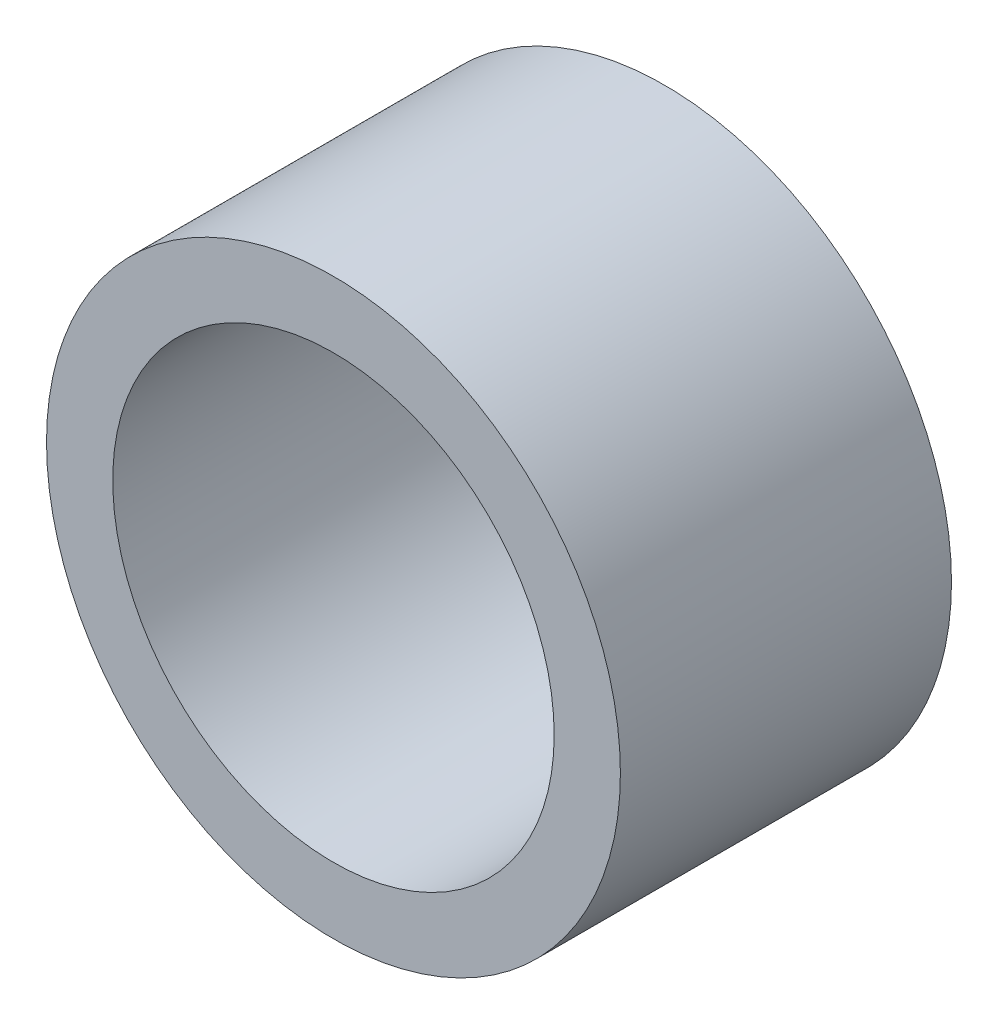
ISO-10303-21;
HEADER;
FILE_DESCRIPTION(('STEP AP214'),'2;1');
FILE_NAME('part.step','',(''),(''),'','','');
FILE_SCHEMA(('AUTOMOTIVE_DESIGN { 1 0 10303 214 1 1 1 1 }'));
ENDSEC;
DATA;
#1=APPLICATION_CONTEXT('core data for automotive mechanical design processes');
#2=APPLICATION_PROTOCOL_DEFINITION('international standard','automotive_design',2000,#1);
#3=PRODUCT_CONTEXT('',#1,'mechanical');
#4=PRODUCT('Part','Part','',(#3));
#5=PRODUCT_RELATED_PRODUCT_CATEGORY('part','',(#4));
#6=PRODUCT_DEFINITION_FORMATION('','',#4);
#7=PRODUCT_DEFINITION_CONTEXT('part definition',#1,'design');
#8=PRODUCT_DEFINITION('design','',#6,#7);
#9=PRODUCT_DEFINITION_SHAPE('','',#8);
#10=(LENGTH_UNIT() NAMED_UNIT(*) SI_UNIT(.MILLI.,.METRE.));
#11=(NAMED_UNIT(*) PLANE_ANGLE_UNIT() SI_UNIT($,.RADIAN.));
#12=(NAMED_UNIT(*) SI_UNIT($,.STERADIAN.) SOLID_ANGLE_UNIT());
#13=UNCERTAINTY_MEASURE_WITH_UNIT(LENGTH_MEASURE(1.E-05),#10,'distance_accuracy_value','');
#14=(GEOMETRIC_REPRESENTATION_CONTEXT(3) GLOBAL_UNCERTAINTY_ASSIGNED_CONTEXT((#13)) GLOBAL_UNIT_ASSIGNED_CONTEXT((#10,
#11,#12)) REPRESENTATION_CONTEXT('',''));
#15=CARTESIAN_POINT('',(0.,0.,0.));
#16=DIRECTION('',(0.,0.,1.));
#17=DIRECTION('',(1.,0.,0.));
#18=AXIS2_PLACEMENT_3D('',#15,#16,#17);
#19=CARTESIAN_POINT('',(0.,0.,15.));
#20=DIRECTION('',(0.,0.,1.));
#21=DIRECTION('',(1.,0.,0.));
#22=AXIS2_PLACEMENT_3D('',#19,#20,#21);
#23=PLANE('',#22);
#24=CARTESIAN_POINT('',(0.,0.,15.));
#25=DIRECTION('',(0.,0.,1.));
#26=DIRECTION('',(1.,0.,0.));
#27=AXIS2_PLACEMENT_3D('',#24,#25,#26);
#28=CIRCLE('',#27,13.);
#29=CARTESIAN_POINT('',(13.,0.,15.));
#30=VERTEX_POINT('',#29);
#31=EDGE_CURVE('E10',#30,#30,#28,.T.);
#32=ORIENTED_EDGE('',*,*,#31,.T.);
#33=EDGE_LOOP('',(#32));
#34=FACE_BOUND('',#33,.T.);
#35=CARTESIAN_POINT('',(0.,0.,15.));
#36=DIRECTION('',(0.,0.,1.));
#37=DIRECTION('',(1.,0.,0.));
#38=AXIS2_PLACEMENT_3D('',#35,#36,#37);
#39=CIRCLE('',#38,10.);
#40=CARTESIAN_POINT('',(10.,0.,15.));
#41=VERTEX_POINT('',#40);
#42=EDGE_CURVE('E42',#41,#41,#39,.T.);
#43=ORIENTED_EDGE('',*,*,#42,.F.);
#44=EDGE_LOOP('',(#43));
#45=FACE_BOUND('',#44,.T.);
#46=ADVANCED_FACE('F31',(#34,#45),#23,.T.);
#47=CARTESIAN_POINT('',(0.,0.,0.));
#48=DIRECTION('',(0.,0.,1.));
#49=DIRECTION('',(1.,0.,0.));
#50=AXIS2_PLACEMENT_3D('',#47,#48,#49);
#51=PLANE('',#50);
#52=CARTESIAN_POINT('',(0.,0.,0.));
#53=DIRECTION('',(0.,0.,1.));
#54=DIRECTION('',(1.,0.,0.));
#55=AXIS2_PLACEMENT_3D('',#52,#53,#54);
#56=CIRCLE('',#55,13.);
#57=CARTESIAN_POINT('',(13.,0.,0.));
#58=VERTEX_POINT('',#57);
#59=EDGE_CURVE('E35',#58,#58,#56,.T.);
#60=ORIENTED_EDGE('',*,*,#59,.F.);
#61=EDGE_LOOP('',(#60));
#62=FACE_BOUND('',#61,.T.);
#63=CARTESIAN_POINT('',(0.,0.,0.));
#64=DIRECTION('',(0.,0.,1.));
#65=DIRECTION('',(1.,0.,0.));
#66=AXIS2_PLACEMENT_3D('',#63,#64,#65);
#67=CIRCLE('',#66,10.);
#68=CARTESIAN_POINT('',(10.,0.,0.));
#69=VERTEX_POINT('',#68);
#70=EDGE_CURVE('E44',#69,#69,#67,.T.);
#71=ORIENTED_EDGE('',*,*,#70,.T.);
#72=EDGE_LOOP('',(#71));
#73=FACE_BOUND('',#72,.T.);
#74=ADVANCED_FACE('F54',(#62,#73),#51,.F.);
#75=CARTESIAN_POINT('',(0.,0.,15.));
#76=DIRECTION('',(0.,0.,-1.));
#77=DIRECTION('',(-1.,0.,0.));
#78=AXIS2_PLACEMENT_3D('',#75,#76,#77);
#79=CYLINDRICAL_SURFACE('',#78,13.);
#80=ORIENTED_EDGE('',*,*,#31,.F.);
#81=EDGE_LOOP('',(#80));
#82=FACE_BOUND('',#81,.T.);
#83=ORIENTED_EDGE('',*,*,#59,.T.);
#84=EDGE_LOOP('',(#83));
#85=FACE_BOUND('',#84,.T.);
#86=ADVANCED_FACE('F33',(#82,#85),#79,.T.);
#87=CARTESIAN_POINT('',(0.,0.,15.));
#88=DIRECTION('',(0.,0.,-1.));
#89=DIRECTION('',(-1.,0.,0.));
#90=AXIS2_PLACEMENT_3D('',#87,#88,#89);
#91=CYLINDRICAL_SURFACE('',#90,10.);
#92=ORIENTED_EDGE('',*,*,#42,.T.);
#93=EDGE_LOOP('',(#92));
#94=FACE_BOUND('',#93,.T.);
#95=ORIENTED_EDGE('',*,*,#70,.F.);
#96=EDGE_LOOP('',(#95));
#97=FACE_BOUND('',#96,.T.);
#98=ADVANCED_FACE('F50',(#94,#97),#91,.F.);
#99=CLOSED_SHELL('',(#46,#74,#86,#98));
#100=MANIFOLD_SOLID_BREP('B2',#99);
#101=ADVANCED_BREP_SHAPE_REPRESENTATION('',(#18,#100),#14);
#102=SHAPE_DEFINITION_REPRESENTATION(#9,#101);
ENDSEC;
END-ISO-10303-21;
